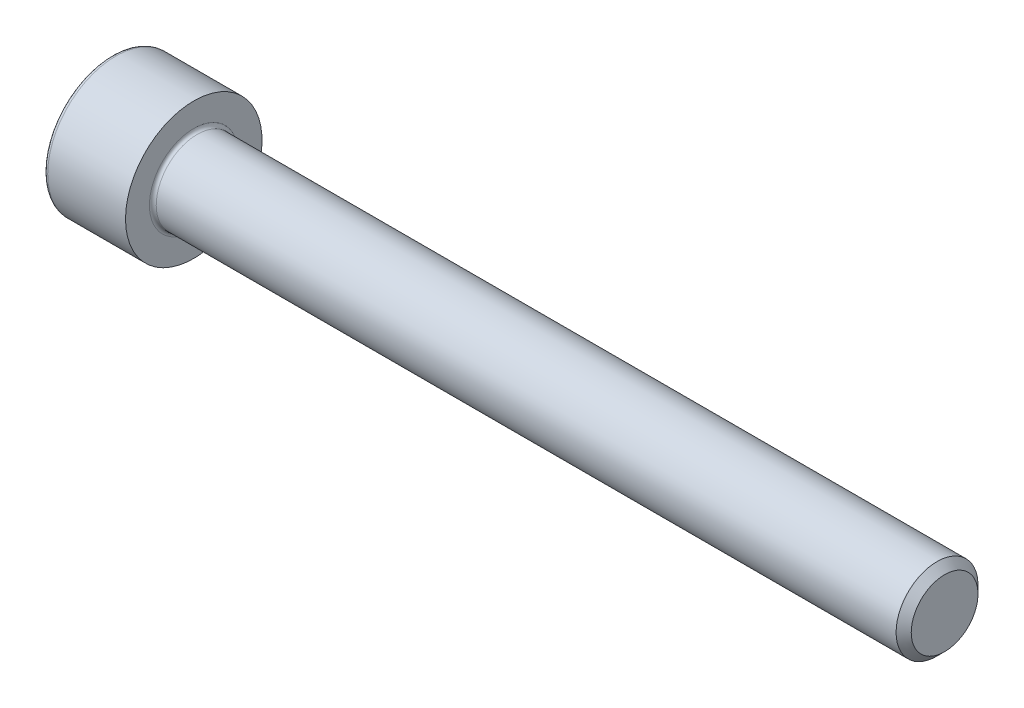
ISO-10303-21;
HEADER;
FILE_DESCRIPTION(('STEP AP214'),'2;1');
FILE_NAME('part.step','',(''),(''),'','','');
FILE_SCHEMA(('AUTOMOTIVE_DESIGN { 1 0 10303 214 1 1 1 1 }'));
ENDSEC;
DATA;
#1=APPLICATION_CONTEXT('core data for automotive mechanical design processes');
#2=APPLICATION_PROTOCOL_DEFINITION('international standard','automotive_design',2000,#1);
#3=PRODUCT_CONTEXT('',#1,'mechanical');
#4=PRODUCT('Part','Part','',(#3));
#5=PRODUCT_RELATED_PRODUCT_CATEGORY('part','',(#4));
#6=PRODUCT_DEFINITION_FORMATION('','',#4);
#7=PRODUCT_DEFINITION_CONTEXT('part definition',#1,'design');
#8=PRODUCT_DEFINITION('design','',#6,#7);
#9=PRODUCT_DEFINITION_SHAPE('','',#8);
#10=(LENGTH_UNIT() NAMED_UNIT(*) SI_UNIT(.MILLI.,.METRE.));
#11=(NAMED_UNIT(*) PLANE_ANGLE_UNIT() SI_UNIT($,.RADIAN.));
#12=(NAMED_UNIT(*) SI_UNIT($,.STERADIAN.) SOLID_ANGLE_UNIT());
#13=UNCERTAINTY_MEASURE_WITH_UNIT(LENGTH_MEASURE(1.E-05),#10,'distance_accuracy_value','');
#14=(GEOMETRIC_REPRESENTATION_CONTEXT(3) GLOBAL_UNCERTAINTY_ASSIGNED_CONTEXT((#13)) GLOBAL_UNIT_ASSIGNED_CONTEXT((#10,
#11,#12)) REPRESENTATION_CONTEXT('',''));
#15=CARTESIAN_POINT('',(0.,0.,0.));
#16=DIRECTION('',(0.,0.,1.));
#17=DIRECTION('',(1.,0.,0.));
#18=AXIS2_PLACEMENT_3D('',#15,#16,#17);
#19=CARTESIAN_POINT('',(0.,0.,0.));
#20=DIRECTION('',(-1.,0.,0.));
#21=DIRECTION('',(0.,0.,1.));
#22=AXIS2_PLACEMENT_3D('',#19,#20,#21);
#23=PLANE('',#22);
#24=DIRECTION('',(0.,-0.499999999999999,0.866025403784439));
#25=VECTOR('',#24,1.);
#26=CARTESIAN_POINT('',(0.,2.93524876856005,0.));
#27=LINE('',#26,#25);
#28=CARTESIAN_POINT('',(0.,2.93524876856005,0.));
#29=VERTEX_POINT('',#28);
#30=CARTESIAN_POINT('',(0.,1.46762438428003,2.54199999999999));
#31=VERTEX_POINT('',#30);
#32=EDGE_CURVE('E261',#29,#31,#27,.T.);
#33=ORIENTED_EDGE('',*,*,#32,.T.);
#34=DIRECTION('',(0.,1.,0.));
#35=VECTOR('',#34,1.);
#36=CARTESIAN_POINT('',(0.,-1.46762438428003,2.542));
#37=LINE('',#36,#35);
#38=CARTESIAN_POINT('',(0.,-1.46762438428003,2.542));
#39=VERTEX_POINT('',#38);
#40=EDGE_CURVE('E133',#39,#31,#37,.T.);
#41=ORIENTED_EDGE('',*,*,#40,.F.);
#42=DIRECTION('',(0.,-0.500000000000001,-0.866025403784438));
#43=VECTOR('',#42,1.);
#44=CARTESIAN_POINT('',(0.,-1.46762438428003,2.542));
#45=LINE('',#44,#43);
#46=CARTESIAN_POINT('',(0.,-2.93524876856006,0.));
#47=VERTEX_POINT('',#46);
#48=EDGE_CURVE('E264',#39,#47,#45,.T.);
#49=ORIENTED_EDGE('',*,*,#48,.T.);
#50=DIRECTION('',(0.,0.499999999999999,-0.866025403784439));
#51=VECTOR('',#50,1.);
#52=CARTESIAN_POINT('',(0.,-2.93524876856006,0.));
#53=LINE('',#52,#51);
#54=CARTESIAN_POINT('',(0.,-1.46762438428004,-2.542));
#55=VERTEX_POINT('',#54);
#56=EDGE_CURVE('E267',#47,#55,#53,.T.);
#57=ORIENTED_EDGE('',*,*,#56,.T.);
#58=DIRECTION('',(0.,-1.,0.));
#59=VECTOR('',#58,1.);
#60=CARTESIAN_POINT('',(0.,1.46762438428002,-2.542));
#61=LINE('',#60,#59);
#62=CARTESIAN_POINT('',(0.,1.46762438428002,-2.542));
#63=VERTEX_POINT('',#62);
#64=EDGE_CURVE('E270',#63,#55,#61,.T.);
#65=ORIENTED_EDGE('',*,*,#64,.F.);
#66=DIRECTION('',(0.,-0.500000000000001,-0.866025403784438));
#67=VECTOR('',#66,1.);
#68=CARTESIAN_POINT('',(0.,2.93524876856005,0.));
#69=LINE('',#68,#67);
#70=EDGE_CURVE('E128',#29,#63,#69,.T.);
#71=ORIENTED_EDGE('',*,*,#70,.F.);
#72=EDGE_LOOP('',(#33,#41,#49,#57,#65,#71));
#73=FACE_BOUND('',#72,.T.);
#74=CARTESIAN_POINT('',(0.,0.,0.));
#75=DIRECTION('',(-1.,0.,0.));
#76=DIRECTION('',(0.,0.,1.));
#77=AXIS2_PLACEMENT_3D('',#74,#75,#76);
#78=CIRCLE('',#77,4.7);
#79=CARTESIAN_POINT('',(0.,0.,4.7));
#80=VERTEX_POINT('',#79);
#81=EDGE_CURVE('E45',#80,#80,#78,.T.);
#82=ORIENTED_EDGE('',*,*,#81,.T.);
#83=EDGE_LOOP('',(#82));
#84=FACE_BOUND('',#83,.T.);
#85=ADVANCED_FACE('F37',(#73,#84),#23,.T.);
#86=CARTESIAN_POINT('',(-31.75,0.,0.));
#87=DIRECTION('',(-1.,0.,0.));
#88=DIRECTION('',(0.,0.,1.));
#89=AXIS2_PLACEMENT_3D('',#86,#87,#88);
#90=CYLINDRICAL_SURFACE('',#89,5.);
#91=CARTESIAN_POINT('',(0.300000000000002,0.,0.));
#92=DIRECTION('',(-1.,0.,0.));
#93=DIRECTION('',(0.,0.,1.));
#94=AXIS2_PLACEMENT_3D('',#91,#92,#93);
#95=CIRCLE('',#94,5.);
#96=CARTESIAN_POINT('',(0.300000000000002,0.,5.));
#97=VERTEX_POINT('',#96);
#98=EDGE_CURVE('E11',#97,#97,#95,.F.);
#99=ORIENTED_EDGE('',*,*,#98,.T.);
#100=EDGE_LOOP('',(#99));
#101=FACE_BOUND('',#100,.T.);
#102=CARTESIAN_POINT('',(6.,0.,0.));
#103=DIRECTION('',(-1.,0.,0.));
#104=DIRECTION('',(0.,0.,1.));
#105=AXIS2_PLACEMENT_3D('',#102,#103,#104);
#106=CIRCLE('',#105,5.);
#107=CARTESIAN_POINT('',(6.,0.,5.));
#108=VERTEX_POINT('',#107);
#109=EDGE_CURVE('E151',#108,#108,#106,.T.);
#110=ORIENTED_EDGE('',*,*,#109,.T.);
#111=EDGE_LOOP('',(#110));
#112=FACE_BOUND('',#111,.T.);
#113=ADVANCED_FACE('F175',(#101,#112),#90,.T.);
#114=CARTESIAN_POINT('',(6.,5.,0.));
#115=DIRECTION('',(1.,0.,0.));
#116=DIRECTION('',(0.,0.,-1.));
#117=AXIS2_PLACEMENT_3D('',#114,#115,#116);
#118=PLANE('',#117);
#119=CARTESIAN_POINT('',(6.,0.,0.));
#120=DIRECTION('',(1.,0.,0.));
#121=DIRECTION('',(0.,0.,-1.));
#122=AXIS2_PLACEMENT_3D('',#119,#120,#121);
#123=CIRCLE('',#122,3.24999999999991);
#124=CARTESIAN_POINT('',(6.,0.,-3.24999999999991));
#125=VERTEX_POINT('',#124);
#126=EDGE_CURVE('E154',#125,#125,#123,.F.);
#127=ORIENTED_EDGE('',*,*,#126,.T.);
#128=EDGE_LOOP('',(#127));
#129=FACE_BOUND('',#128,.T.);
#130=ORIENTED_EDGE('',*,*,#109,.F.);
#131=EDGE_LOOP('',(#130));
#132=FACE_BOUND('',#131,.T.);
#133=ADVANCED_FACE('F181',(#129,#132),#118,.T.);
#134=CARTESIAN_POINT('',(-31.75,0.,0.));
#135=DIRECTION('',(-1.,0.,0.));
#136=DIRECTION('',(0.,0.,1.));
#137=AXIS2_PLACEMENT_3D('',#134,#135,#136);
#138=CYLINDRICAL_SURFACE('',#137,2.99999999999991);
#139=CARTESIAN_POINT('',(6.25000000000001,0.,0.));
#140=DIRECTION('',(1.,0.,0.));
#141=DIRECTION('',(0.,0.,-1.));
#142=AXIS2_PLACEMENT_3D('',#139,#140,#141);
#143=CIRCLE('',#142,2.99999999999991);
#144=CARTESIAN_POINT('',(6.25000000000001,0.,-2.99999999999991));
#145=VERTEX_POINT('',#144);
#146=EDGE_CURVE('E157',#145,#145,#143,.T.);
#147=ORIENTED_EDGE('',*,*,#146,.T.);
#148=EDGE_LOOP('',(#147));
#149=FACE_BOUND('',#148,.T.);
#150=CARTESIAN_POINT('',(60.4454999999998,0.,0.));
#151=DIRECTION('',(-1.,0.,0.));
#152=DIRECTION('',(0.,0.,1.));
#153=AXIS2_PLACEMENT_3D('',#150,#151,#152);
#154=CIRCLE('',#153,2.99999999999982);
#155=CARTESIAN_POINT('',(60.4454999999998,0.,2.99999999999982));
#156=VERTEX_POINT('',#155);
#157=EDGE_CURVE('E148',#156,#156,#154,.T.);
#158=ORIENTED_EDGE('',*,*,#157,.T.);
#159=EDGE_LOOP('',(#158));
#160=FACE_BOUND('',#159,.T.);
#161=ADVANCED_FACE('F187',(#149,#160),#138,.T.);
#162=CARTESIAN_POINT('',(61.,0.,0.));
#163=DIRECTION('',(-1.,0.,0.));
#164=DIRECTION('',(0.,0.,1.));
#165=AXIS2_PLACEMENT_3D('',#162,#163,#164);
#166=CONICAL_SURFACE('',#165,2.4455,0.785398163397137);
#167=ORIENTED_EDGE('',*,*,#157,.F.);
#168=EDGE_LOOP('',(#167));
#169=FACE_BOUND('',#168,.T.);
#170=CARTESIAN_POINT('',(61.,0.,0.));
#171=DIRECTION('',(-1.,0.,0.));
#172=DIRECTION('',(0.,0.,1.));
#173=AXIS2_PLACEMENT_3D('',#170,#171,#172);
#174=CIRCLE('',#173,2.4455);
#175=CARTESIAN_POINT('',(61.,0.,2.4455));
#176=VERTEX_POINT('',#175);
#177=EDGE_CURVE('E144',#176,#176,#174,.T.);
#178=ORIENTED_EDGE('',*,*,#177,.T.);
#179=EDGE_LOOP('',(#178));
#180=FACE_BOUND('',#179,.T.);
#181=ADVANCED_FACE('F191',(#169,#180),#166,.T.);
#182=CARTESIAN_POINT('',(61.,2.4455,0.));
#183=DIRECTION('',(1.,0.,0.));
#184=DIRECTION('',(0.,0.,-1.));
#185=AXIS2_PLACEMENT_3D('',#182,#183,#184);
#186=PLANE('',#185);
#187=ORIENTED_EDGE('',*,*,#177,.F.);
#188=EDGE_LOOP('',(#187));
#189=FACE_BOUND('',#188,.T.);
#190=ADVANCED_FACE('F171',(#189),#186,.T.);
#191=CARTESIAN_POINT('',(6.25000000000001,0.,0.));
#192=DIRECTION('',(1.,0.,0.));
#193=DIRECTION('',(0.,0.,-1.));
#194=AXIS2_PLACEMENT_3D('',#191,#192,#193);
#195=TOROIDAL_SURFACE('',#194,3.24999999999991,0.25);
#196=ORIENTED_EDGE('',*,*,#146,.F.);
#197=EDGE_LOOP('',(#196));
#198=FACE_BOUND('',#197,.T.);
#199=ORIENTED_EDGE('',*,*,#126,.F.);
#200=EDGE_LOOP('',(#199));
#201=FACE_BOUND('',#200,.T.);
#202=ADVANCED_FACE('F164',(#198,#201),#195,.F.);
#203=CARTESIAN_POINT('',(0.300000000000002,0.,0.));
#204=DIRECTION('',(-1.,0.,0.));
#205=DIRECTION('',(0.,0.,1.));
#206=AXIS2_PLACEMENT_3D('',#203,#204,#205);
#207=TOROIDAL_SURFACE('',#206,4.7,0.3);
#208=ORIENTED_EDGE('',*,*,#98,.F.);
#209=EDGE_LOOP('',(#208));
#210=FACE_BOUND('',#209,.T.);
#211=ORIENTED_EDGE('',*,*,#81,.F.);
#212=EDGE_LOOP('',(#211));
#213=FACE_BOUND('',#212,.T.);
#214=ADVANCED_FACE('F39',(#210,#213),#207,.T.);
#215=CARTESIAN_POINT('',(3.,2.93524876856005,0.));
#216=DIRECTION('',(0.,-0.866025403784439,-0.499999999999999));
#217=DIRECTION('',(0.,0.499999999999999,-0.866025403784439));
#218=AXIS2_PLACEMENT_3D('',#215,#216,#217);
#219=PLANE('',#218);
#220=ORIENTED_EDGE('',*,*,#32,.F.);
#221=DIRECTION('',(-1.,0.,0.));
#222=VECTOR('',#221,1.);
#223=CARTESIAN_POINT('',(3.,2.93524876856005,0.));
#224=LINE('',#223,#222);
#225=CARTESIAN_POINT('',(3.,2.93524876856005,0.));
#226=VERTEX_POINT('',#225);
#227=EDGE_CURVE('E251',#226,#29,#224,.T.);
#228=ORIENTED_EDGE('',*,*,#227,.F.);
#229=DIRECTION('',(0.,-0.499999999999999,0.866025403784439));
#230=VECTOR('',#229,1.);
#231=CARTESIAN_POINT('',(3.,2.93524876856005,0.));
#232=LINE('',#231,#230);
#233=CARTESIAN_POINT('',(3.,2.20143657642004,1.271));
#234=VERTEX_POINT('',#233);
#235=EDGE_CURVE('E120',#226,#234,#232,.T.);
#236=ORIENTED_EDGE('',*,*,#235,.T.);
#237=CARTESIAN_POINT('',(3.,1.46762438428003,2.54199999999999));
#238=VERTEX_POINT('',#237);
#239=EDGE_CURVE('E111',#234,#238,#232,.T.);
#240=ORIENTED_EDGE('',*,*,#239,.T.);
#241=DIRECTION('',(-1.,0.,0.));
#242=VECTOR('',#241,1.);
#243=CARTESIAN_POINT('',(3.,1.46762438428003,2.54199999999999));
#244=LINE('',#243,#242);
#245=EDGE_CURVE('E125',#238,#31,#244,.T.);
#246=ORIENTED_EDGE('',*,*,#245,.T.);
#247=EDGE_LOOP('',(#220,#228,#236,#240,#246));
#248=FACE_BOUND('',#247,.T.);
#249=ADVANCED_FACE('F124',(#248),#219,.T.);
#250=CARTESIAN_POINT('',(3.,-1.46762438428003,2.542));
#251=DIRECTION('',(0.,0.,1.));
#252=DIRECTION('',(0.,-1.,0.));
#253=AXIS2_PLACEMENT_3D('',#250,#251,#252);
#254=PLANE('',#253);
#255=ORIENTED_EDGE('',*,*,#40,.T.);
#256=ORIENTED_EDGE('',*,*,#245,.F.);
#257=DIRECTION('',(0.,1.,0.));
#258=VECTOR('',#257,1.);
#259=CARTESIAN_POINT('',(3.,-1.46762438428003,2.542));
#260=LINE('',#259,#258);
#261=CARTESIAN_POINT('',(3.,0.,2.542));
#262=VERTEX_POINT('',#261);
#263=EDGE_CURVE('E108',#262,#238,#260,.T.);
#264=ORIENTED_EDGE('',*,*,#263,.F.);
#265=CARTESIAN_POINT('',(3.,-1.46762438428003,2.542));
#266=VERTEX_POINT('',#265);
#267=EDGE_CURVE('E119',#266,#262,#260,.T.);
#268=ORIENTED_EDGE('',*,*,#267,.F.);
#269=DIRECTION('',(-1.,0.,0.));
#270=VECTOR('',#269,1.);
#271=CARTESIAN_POINT('',(3.,-1.46762438428003,2.542));
#272=LINE('',#271,#270);
#273=EDGE_CURVE('E135',#266,#39,#272,.T.);
#274=ORIENTED_EDGE('',*,*,#273,.T.);
#275=EDGE_LOOP('',(#255,#256,#264,#268,#274));
#276=FACE_BOUND('',#275,.T.);
#277=ADVANCED_FACE('F130',(#276),#254,.F.);
#278=CARTESIAN_POINT('',(3.,-1.46762438428003,2.542));
#279=DIRECTION('',(0.,0.866025403784438,-0.500000000000001));
#280=DIRECTION('',(0.,0.500000000000001,0.866025403784438));
#281=AXIS2_PLACEMENT_3D('',#278,#279,#280);
#282=PLANE('',#281);
#283=ORIENTED_EDGE('',*,*,#48,.F.);
#284=ORIENTED_EDGE('',*,*,#273,.F.);
#285=DIRECTION('',(0.,-0.500000000000001,-0.866025403784438));
#286=VECTOR('',#285,1.);
#287=CARTESIAN_POINT('',(3.,-1.46762438428003,2.542));
#288=LINE('',#287,#286);
#289=CARTESIAN_POINT('',(3.,-2.20143657642004,1.271));
#290=VERTEX_POINT('',#289);
#291=EDGE_CURVE('E290',#266,#290,#288,.T.);
#292=ORIENTED_EDGE('',*,*,#291,.T.);
#293=CARTESIAN_POINT('',(3.,-2.93524876856006,0.));
#294=VERTEX_POINT('',#293);
#295=EDGE_CURVE('E279',#290,#294,#288,.T.);
#296=ORIENTED_EDGE('',*,*,#295,.T.);
#297=DIRECTION('',(-1.,0.,0.));
#298=VECTOR('',#297,1.);
#299=CARTESIAN_POINT('',(3.,-2.93524876856006,0.));
#300=LINE('',#299,#298);
#301=EDGE_CURVE('E140',#294,#47,#300,.T.);
#302=ORIENTED_EDGE('',*,*,#301,.T.);
#303=EDGE_LOOP('',(#283,#284,#292,#296,#302));
#304=FACE_BOUND('',#303,.T.);
#305=ADVANCED_FACE('F205',(#304),#282,.T.);
#306=CARTESIAN_POINT('',(3.,-2.93524876856006,0.));
#307=DIRECTION('',(0.,0.866025403784439,0.499999999999999));
#308=DIRECTION('',(0.,-0.499999999999999,0.866025403784439));
#309=AXIS2_PLACEMENT_3D('',#306,#307,#308);
#310=PLANE('',#309);
#311=ORIENTED_EDGE('',*,*,#56,.F.);
#312=ORIENTED_EDGE('',*,*,#301,.F.);
#313=DIRECTION('',(0.,0.499999999999999,-0.866025403784439));
#314=VECTOR('',#313,1.);
#315=CARTESIAN_POINT('',(3.,-2.93524876856006,0.));
#316=LINE('',#315,#314);
#317=CARTESIAN_POINT('',(3.,-2.20143657642005,-1.271));
#318=VERTEX_POINT('',#317);
#319=EDGE_CURVE('E257',#294,#318,#316,.T.);
#320=ORIENTED_EDGE('',*,*,#319,.T.);
#321=CARTESIAN_POINT('',(3.,-1.46762438428004,-2.542));
#322=VERTEX_POINT('',#321);
#323=EDGE_CURVE('E289',#318,#322,#316,.T.);
#324=ORIENTED_EDGE('',*,*,#323,.T.);
#325=DIRECTION('',(-1.,0.,0.));
#326=VECTOR('',#325,1.);
#327=CARTESIAN_POINT('',(3.,-1.46762438428004,-2.542));
#328=LINE('',#327,#326);
#329=EDGE_CURVE('E250',#322,#55,#328,.T.);
#330=ORIENTED_EDGE('',*,*,#329,.T.);
#331=EDGE_LOOP('',(#311,#312,#320,#324,#330));
#332=FACE_BOUND('',#331,.T.);
#333=ADVANCED_FACE('F208',(#332),#310,.T.);
#334=CARTESIAN_POINT('',(3.,1.46762438428002,-2.542));
#335=DIRECTION('',(0.,0.,-1.));
#336=DIRECTION('',(0.,1.,0.));
#337=AXIS2_PLACEMENT_3D('',#334,#335,#336);
#338=PLANE('',#337);
#339=ORIENTED_EDGE('',*,*,#64,.T.);
#340=ORIENTED_EDGE('',*,*,#329,.F.);
#341=DIRECTION('',(0.,-1.,0.));
#342=VECTOR('',#341,1.);
#343=CARTESIAN_POINT('',(3.,1.46762438428002,-2.542));
#344=LINE('',#343,#342);
#345=CARTESIAN_POINT('',(3.,0.,-2.542));
#346=VERTEX_POINT('',#345);
#347=EDGE_CURVE('E254',#346,#322,#344,.T.);
#348=ORIENTED_EDGE('',*,*,#347,.F.);
#349=CARTESIAN_POINT('',(3.,1.46762438428002,-2.542));
#350=VERTEX_POINT('',#349);
#351=EDGE_CURVE('E52',#350,#346,#344,.T.);
#352=ORIENTED_EDGE('',*,*,#351,.F.);
#353=DIRECTION('',(-1.,0.,0.));
#354=VECTOR('',#353,1.);
#355=CARTESIAN_POINT('',(3.,1.46762438428002,-2.542));
#356=LINE('',#355,#354);
#357=EDGE_CURVE('E247',#350,#63,#356,.T.);
#358=ORIENTED_EDGE('',*,*,#357,.T.);
#359=EDGE_LOOP('',(#339,#340,#348,#352,#358));
#360=FACE_BOUND('',#359,.T.);
#361=ADVANCED_FACE('F212',(#360),#338,.F.);
#362=CARTESIAN_POINT('',(3.,2.93524876856005,0.));
#363=DIRECTION('',(0.,0.866025403784438,-0.500000000000001));
#364=DIRECTION('',(0.,0.500000000000001,0.866025403784438));
#365=AXIS2_PLACEMENT_3D('',#362,#363,#364);
#366=PLANE('',#365);
#367=ORIENTED_EDGE('',*,*,#70,.T.);
#368=ORIENTED_EDGE('',*,*,#357,.F.);
#369=DIRECTION('',(0.,-0.500000000000001,-0.866025403784438));
#370=VECTOR('',#369,1.);
#371=CARTESIAN_POINT('',(3.,2.93524876856005,0.));
#372=LINE('',#371,#370);
#373=CARTESIAN_POINT('',(3.,2.20143657642004,-1.271));
#374=VERTEX_POINT('',#373);
#375=EDGE_CURVE('E237',#374,#350,#372,.T.);
#376=ORIENTED_EDGE('',*,*,#375,.F.);
#377=EDGE_CURVE('E243',#226,#374,#372,.T.);
#378=ORIENTED_EDGE('',*,*,#377,.F.);
#379=ORIENTED_EDGE('',*,*,#227,.T.);
#380=EDGE_LOOP('',(#367,#368,#376,#378,#379));
#381=FACE_BOUND('',#380,.T.);
#382=ADVANCED_FACE('F216',(#381),#366,.F.);
#383=CARTESIAN_POINT('',(3.,2.93524876856005,0.));
#384=DIRECTION('',(1.,0.,0.));
#385=DIRECTION('',(0.,0.,-1.));
#386=AXIS2_PLACEMENT_3D('',#383,#384,#385);
#387=PLANE('',#386);
#388=ORIENTED_EDGE('',*,*,#347,.T.);
#389=ORIENTED_EDGE('',*,*,#323,.F.);
#390=CARTESIAN_POINT('',(3.,0.,0.));
#391=DIRECTION('',(-1.,0.,0.));
#392=DIRECTION('',(0.,0.,1.));
#393=AXIS2_PLACEMENT_3D('',#390,#391,#392);
#394=CIRCLE('',#393,2.542);
#395=EDGE_CURVE('E285',#346,#318,#394,.T.);
#396=ORIENTED_EDGE('',*,*,#395,.F.);
#397=EDGE_LOOP('',(#388,#389,#396));
#398=FACE_BOUND('',#397,.T.);
#399=ADVANCED_FACE('F220',(#398),#387,.F.);
#400=ORIENTED_EDGE('',*,*,#319,.F.);
#401=ORIENTED_EDGE('',*,*,#295,.F.);
#402=EDGE_CURVE('E138',#318,#290,#394,.T.);
#403=ORIENTED_EDGE('',*,*,#402,.F.);
#404=EDGE_LOOP('',(#400,#401,#403));
#405=FACE_BOUND('',#404,.T.);
#406=ADVANCED_FACE('F223',(#405),#387,.F.);
#407=ORIENTED_EDGE('',*,*,#291,.F.);
#408=ORIENTED_EDGE('',*,*,#267,.T.);
#409=EDGE_CURVE('E134',#290,#262,#394,.T.);
#410=ORIENTED_EDGE('',*,*,#409,.F.);
#411=EDGE_LOOP('',(#407,#408,#410));
#412=FACE_BOUND('',#411,.T.);
#413=ADVANCED_FACE('F228',(#412),#387,.F.);
#414=ORIENTED_EDGE('',*,*,#263,.T.);
#415=ORIENTED_EDGE('',*,*,#239,.F.);
#416=EDGE_CURVE('E114',#262,#234,#394,.T.);
#417=ORIENTED_EDGE('',*,*,#416,.F.);
#418=EDGE_LOOP('',(#414,#415,#417));
#419=FACE_BOUND('',#418,.T.);
#420=ADVANCED_FACE('F110',(#419),#387,.F.);
#421=ORIENTED_EDGE('',*,*,#235,.F.);
#422=ORIENTED_EDGE('',*,*,#377,.T.);
#423=EDGE_CURVE('E145',#234,#374,#394,.T.);
#424=ORIENTED_EDGE('',*,*,#423,.F.);
#425=EDGE_LOOP('',(#421,#422,#424));
#426=FACE_BOUND('',#425,.T.);
#427=ADVANCED_FACE('F231',(#426),#387,.F.);
#428=ORIENTED_EDGE('',*,*,#375,.T.);
#429=ORIENTED_EDGE('',*,*,#351,.T.);
#430=EDGE_CURVE('E240',#374,#346,#394,.T.);
#431=ORIENTED_EDGE('',*,*,#430,.F.);
#432=EDGE_LOOP('',(#428,#429,#431));
#433=FACE_BOUND('',#432,.T.);
#434=ADVANCED_FACE('F201',(#433),#387,.F.);
#435=CARTESIAN_POINT('',(3.,0.,0.));
#436=DIRECTION('',(-1.,0.,0.));
#437=DIRECTION('',(0.,0.,1.));
#438=AXIS2_PLACEMENT_3D('',#435,#436,#437);
#439=CONICAL_SURFACE('',#438,2.542,1.04719755119659);
#440=CARTESIAN_POINT('',(4.46762438428005,0.,0.));
#441=VERTEX_POINT('',#440);
#442=VERTEX_LOOP('',#441);
#443=FACE_BOUND('',#442,.T.);
#444=ORIENTED_EDGE('',*,*,#416,.T.);
#445=ORIENTED_EDGE('',*,*,#423,.T.);
#446=ORIENTED_EDGE('',*,*,#430,.T.);
#447=ORIENTED_EDGE('',*,*,#395,.T.);
#448=ORIENTED_EDGE('',*,*,#402,.T.);
#449=ORIENTED_EDGE('',*,*,#409,.T.);
#450=EDGE_LOOP('',(#444,#445,#446,#447,#448,#449));
#451=FACE_BOUND('',#450,.T.);
#452=ADVANCED_FACE('F199',(#443,#451),#439,.F.);
#453=CLOSED_SHELL('',(#85,#113,#133,#161,#181,#190,#202,#214,#249,#277,#305,#333,#361,#382,#399,
#406,#413,#420,#427,#434,#452));
#454=MANIFOLD_SOLID_BREP('B2',#453);
#455=ADVANCED_BREP_SHAPE_REPRESENTATION('',(#18,#454),#14);
#456=SHAPE_DEFINITION_REPRESENTATION(#9,#455);
ENDSEC;
END-ISO-10303-21;
